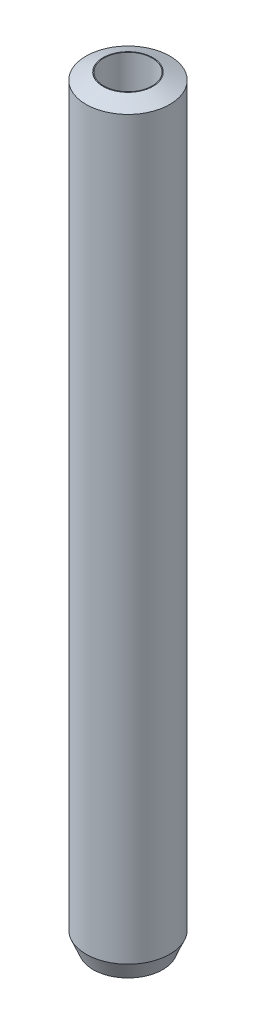
ISO-10303-21;
HEADER;
FILE_DESCRIPTION(('STEP AP214'),'2;1');
FILE_NAME('part.step','',(''),(''),'','','');
FILE_SCHEMA(('AUTOMOTIVE_DESIGN { 1 0 10303 214 1 1 1 1 }'));
ENDSEC;
DATA;
#1=APPLICATION_CONTEXT('core data for automotive mechanical design processes');
#2=APPLICATION_PROTOCOL_DEFINITION('international standard','automotive_design',2000,#1);
#3=PRODUCT_CONTEXT('',#1,'mechanical');
#4=PRODUCT('Part','Part','',(#3));
#5=PRODUCT_RELATED_PRODUCT_CATEGORY('part','',(#4));
#6=PRODUCT_DEFINITION_FORMATION('','',#4);
#7=PRODUCT_DEFINITION_CONTEXT('part definition',#1,'design');
#8=PRODUCT_DEFINITION('design','',#6,#7);
#9=PRODUCT_DEFINITION_SHAPE('','',#8);
#10=(LENGTH_UNIT() NAMED_UNIT(*) SI_UNIT(.MILLI.,.METRE.));
#11=(NAMED_UNIT(*) PLANE_ANGLE_UNIT() SI_UNIT($,.RADIAN.));
#12=(NAMED_UNIT(*) SI_UNIT($,.STERADIAN.) SOLID_ANGLE_UNIT());
#13=UNCERTAINTY_MEASURE_WITH_UNIT(LENGTH_MEASURE(1.E-05),#10,'distance_accuracy_value','');
#14=(GEOMETRIC_REPRESENTATION_CONTEXT(3) GLOBAL_UNCERTAINTY_ASSIGNED_CONTEXT((#13)) GLOBAL_UNIT_ASSIGNED_CONTEXT((#10,
#11,#12)) REPRESENTATION_CONTEXT('',''));
#15=CARTESIAN_POINT('',(0.,0.,0.));
#16=DIRECTION('',(0.,0.,1.));
#17=DIRECTION('',(1.,0.,0.));
#18=AXIS2_PLACEMENT_3D('',#15,#16,#17);
#19=CARTESIAN_POINT('',(0.,543.977092285327,0.));
#20=DIRECTION('',(0.,-1.,0.));
#21=DIRECTION('',(0.,0.,-1.));
#22=AXIS2_PLACEMENT_3D('',#19,#20,#21);
#23=CYLINDRICAL_SURFACE('',#22,30.);
#24=CARTESIAN_POINT('',(0.,538.89238320397,0.));
#25=DIRECTION('',(0.,1.,0.));
#26=DIRECTION('',(0.,0.,1.));
#27=AXIS2_PLACEMENT_3D('',#24,#25,#26);
#28=CIRCLE('',#27,30.);
#29=CARTESIAN_POINT('',(0.,538.89238320397,30.));
#30=VERTEX_POINT('',#29);
#31=EDGE_CURVE('E50',#30,#30,#28,.F.);
#32=ORIENTED_EDGE('',*,*,#31,.T.);
#33=EDGE_LOOP('',(#32));
#34=FACE_BOUND('',#33,.T.);
#35=CARTESIAN_POINT('',(0.,12.1402067848627,0.));
#36=DIRECTION('',(0.,1.,0.));
#37=DIRECTION('',(0.,0.,1.));
#38=AXIS2_PLACEMENT_3D('',#35,#36,#37);
#39=CIRCLE('',#38,30.);
#40=CARTESIAN_POINT('',(0.,12.1402067848627,30.));
#41=VERTEX_POINT('',#40);
#42=EDGE_CURVE('E51',#41,#41,#39,.T.);
#43=ORIENTED_EDGE('',*,*,#42,.T.);
#44=EDGE_LOOP('',(#43));
#45=FACE_BOUND('',#44,.T.);
#46=ADVANCED_FACE('F39',(#34,#45),#23,.T.);
#47=CARTESIAN_POINT('',(0.,543.977092285327,0.));
#48=DIRECTION('',(0.,1.,0.));
#49=DIRECTION('',(0.,0.,1.));
#50=AXIS2_PLACEMENT_3D('',#47,#48,#49);
#51=PLANE('',#50);
#52=CARTESIAN_POINT('',(0.,543.977092285327,0.));
#53=DIRECTION('',(0.,1.,0.));
#54=DIRECTION('',(0.,0.,1.));
#55=AXIS2_PLACEMENT_3D('',#52,#53,#54);
#56=CIRCLE('',#55,17.8597932151371);
#57=CARTESIAN_POINT('',(0.,543.977092285327,17.8597932151371));
#58=VERTEX_POINT('',#57);
#59=EDGE_CURVE('E54',#58,#58,#56,.T.);
#60=ORIENTED_EDGE('',*,*,#59,.T.);
#61=EDGE_LOOP('',(#60));
#62=FACE_BOUND('',#61,.T.);
#63=CARTESIAN_POINT('',(0.,543.977092285327,0.));
#64=DIRECTION('',(0.,1.,0.));
#65=DIRECTION('',(0.,0.,1.));
#66=AXIS2_PLACEMENT_3D('',#63,#64,#65);
#67=CIRCLE('',#66,17.3155165233743);
#68=CARTESIAN_POINT('',(0.,543.977092285327,17.3155165233743));
#69=VERTEX_POINT('',#68);
#70=EDGE_CURVE('E58',#69,#69,#67,.T.);
#71=ORIENTED_EDGE('',*,*,#70,.F.);
#72=EDGE_LOOP('',(#71));
#73=FACE_BOUND('',#72,.T.);
#74=ADVANCED_FACE('F69',(#62,#73),#51,.T.);
#75=CARTESIAN_POINT('',(0.,0.,0.));
#76=DIRECTION('',(0.,1.,0.));
#77=DIRECTION('',(0.,0.,1.));
#78=AXIS2_PLACEMENT_3D('',#75,#76,#77);
#79=PLANE('',#78);
#80=CARTESIAN_POINT('',(0.,0.,0.));
#81=DIRECTION('',(0.,1.,0.));
#82=DIRECTION('',(0.,0.,1.));
#83=AXIS2_PLACEMENT_3D('',#80,#81,#82);
#84=CIRCLE('',#83,24.9152909186438);
#85=CARTESIAN_POINT('',(0.,0.,24.9152909186438));
#86=VERTEX_POINT('',#85);
#87=EDGE_CURVE('E10',#86,#86,#84,.F.);
#88=ORIENTED_EDGE('',*,*,#87,.T.);
#89=EDGE_LOOP('',(#88));
#90=FACE_BOUND('',#89,.T.);
#91=CARTESIAN_POINT('',(0.,0.,0.));
#92=DIRECTION('',(0.,1.,0.));
#93=DIRECTION('',(0.,0.,1.));
#94=AXIS2_PLACEMENT_3D('',#91,#92,#93);
#95=CIRCLE('',#94,17.3155165233743);
#96=CARTESIAN_POINT('',(0.,0.,17.3155165233743));
#97=VERTEX_POINT('',#96);
#98=EDGE_CURVE('E63',#97,#97,#95,.T.);
#99=ORIENTED_EDGE('',*,*,#98,.T.);
#100=EDGE_LOOP('',(#99));
#101=FACE_BOUND('',#100,.T.);
#102=ADVANCED_FACE('F75',(#90,#101),#79,.F.);
#103=CARTESIAN_POINT('',(0.,543.977092285327,0.));
#104=DIRECTION('',(0.,-1.,0.));
#105=DIRECTION('',(0.,0.,-1.));
#106=AXIS2_PLACEMENT_3D('',#103,#104,#105);
#107=CYLINDRICAL_SURFACE('',#106,17.3155165233743);
#108=ORIENTED_EDGE('',*,*,#70,.T.);
#109=EDGE_LOOP('',(#108));
#110=FACE_BOUND('',#109,.T.);
#111=ORIENTED_EDGE('',*,*,#98,.F.);
#112=EDGE_LOOP('',(#111));
#113=FACE_BOUND('',#112,.T.);
#114=ADVANCED_FACE('F70',(#110,#113),#107,.F.);
#115=CARTESIAN_POINT('',(0.,543.977092285327,0.));
#116=DIRECTION('',(0.,-1.,0.));
#117=DIRECTION('',(0.,0.,-1.));
#118=AXIS2_PLACEMENT_3D('',#115,#116,#117);
#119=CONICAL_SURFACE('',#118,17.8597932151371,1.174161469032);
#120=ORIENTED_EDGE('',*,*,#31,.F.);
#121=EDGE_LOOP('',(#120));
#122=FACE_BOUND('',#121,.T.);
#123=ORIENTED_EDGE('',*,*,#59,.F.);
#124=EDGE_LOOP('',(#123));
#125=FACE_BOUND('',#124,.T.);
#126=ADVANCED_FACE('F81',(#122,#125),#119,.T.);
#127=CARTESIAN_POINT('',(0.,12.1402067848627,0.));
#128=DIRECTION('',(0.,1.,0.));
#129=DIRECTION('',(0.,0.,1.));
#130=AXIS2_PLACEMENT_3D('',#127,#128,#129);
#131=CONICAL_SURFACE('',#130,30.,0.396634857762896);
#132=ORIENTED_EDGE('',*,*,#87,.F.);
#133=EDGE_LOOP('',(#132));
#134=FACE_BOUND('',#133,.T.);
#135=ORIENTED_EDGE('',*,*,#42,.F.);
#136=EDGE_LOOP('',(#135));
#137=FACE_BOUND('',#136,.T.);
#138=ADVANCED_FACE('F45',(#134,#137),#131,.T.);
#139=CLOSED_SHELL('',(#46,#74,#102,#114,#126,#138));
#140=MANIFOLD_SOLID_BREP('B2',#139);
#141=ADVANCED_BREP_SHAPE_REPRESENTATION('',(#18,#140),#14);
#142=SHAPE_DEFINITION_REPRESENTATION(#9,#141);
ENDSEC;
END-ISO-10303-21;
